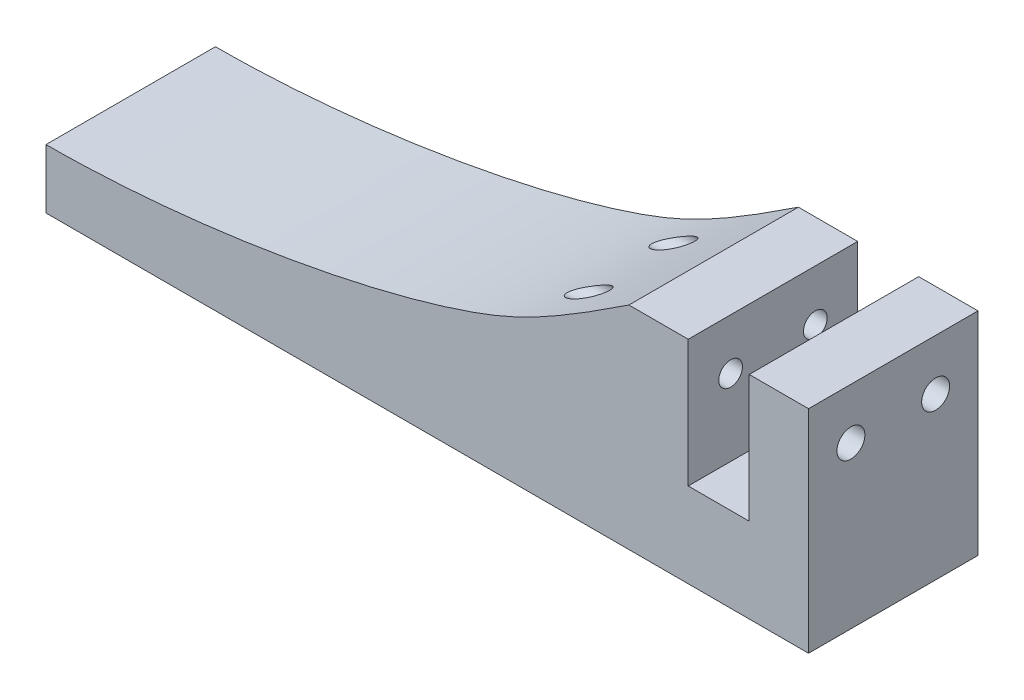
ISO-10303-21;
HEADER;
FILE_DESCRIPTION(('STEP AP214'),'2;1');
FILE_NAME('part.step','',(''),(''),'','','');
FILE_SCHEMA(('AUTOMOTIVE_DESIGN { 1 0 10303 214 1 1 1 1 }'));
ENDSEC;
DATA;
#1=APPLICATION_CONTEXT('core data for automotive mechanical design processes');
#2=APPLICATION_PROTOCOL_DEFINITION('international standard','automotive_design',2000,#1);
#3=PRODUCT_CONTEXT('',#1,'mechanical');
#4=PRODUCT('Part','Part','',(#3));
#5=PRODUCT_RELATED_PRODUCT_CATEGORY('part','',(#4));
#6=PRODUCT_DEFINITION_FORMATION('','',#4);
#7=PRODUCT_DEFINITION_CONTEXT('part definition',#1,'design');
#8=PRODUCT_DEFINITION('design','',#6,#7);
#9=PRODUCT_DEFINITION_SHAPE('','',#8);
#10=(LENGTH_UNIT() NAMED_UNIT(*) SI_UNIT(.MILLI.,.METRE.));
#11=(NAMED_UNIT(*) PLANE_ANGLE_UNIT() SI_UNIT($,.RADIAN.));
#12=(NAMED_UNIT(*) SI_UNIT($,.STERADIAN.) SOLID_ANGLE_UNIT());
#13=UNCERTAINTY_MEASURE_WITH_UNIT(LENGTH_MEASURE(1.E-05),#10,'distance_accuracy_value','');
#14=(GEOMETRIC_REPRESENTATION_CONTEXT(3) GLOBAL_UNCERTAINTY_ASSIGNED_CONTEXT((#13)) GLOBAL_UNIT_ASSIGNED_CONTEXT((#10,
#11,#12)) REPRESENTATION_CONTEXT('',''));
#15=CARTESIAN_POINT('',(0.,0.,0.));
#16=DIRECTION('',(0.,0.,1.));
#17=DIRECTION('',(1.,0.,0.));
#18=AXIS2_PLACEMENT_3D('',#15,#16,#17);
#19=CARTESIAN_POINT('',(7.,123.395512054749,20.));
#20=DIRECTION('',(0.,-1.,0.));
#21=DIRECTION('',(0.,0.,-1.));
#22=AXIS2_PLACEMENT_3D('',#19,#20,#21);
#23=PLANE('',#22);
#24=DIRECTION('',(-1.,0.,0.));
#25=VECTOR('',#24,1.);
#26=CARTESIAN_POINT('',(7.,123.395512054749,0.));
#27=LINE('',#26,#25);
#28=CARTESIAN_POINT('',(7.,123.395512054749,0.));
#29=VERTEX_POINT('',#28);
#30=CARTESIAN_POINT('',(0.,123.395512054749,0.));
#31=VERTEX_POINT('',#30);
#32=EDGE_CURVE('E159',#29,#31,#27,.T.);
#33=ORIENTED_EDGE('',*,*,#32,.T.);
#34=DIRECTION('',(0.,0.,-1.));
#35=VECTOR('',#34,1.);
#36=CARTESIAN_POINT('',(0.,123.395512054749,20.));
#37=LINE('',#36,#35);
#38=CARTESIAN_POINT('',(0.,123.395512054749,20.));
#39=VERTEX_POINT('',#38);
#40=EDGE_CURVE('E11',#39,#31,#37,.T.);
#41=ORIENTED_EDGE('',*,*,#40,.F.);
#42=DIRECTION('',(-1.,0.,0.));
#43=VECTOR('',#42,1.);
#44=CARTESIAN_POINT('',(7.,123.395512054749,20.));
#45=LINE('',#44,#43);
#46=CARTESIAN_POINT('',(7.,123.395512054749,20.));
#47=VERTEX_POINT('',#46);
#48=EDGE_CURVE('E190',#47,#39,#45,.T.);
#49=ORIENTED_EDGE('',*,*,#48,.F.);
#50=DIRECTION('',(0.,0.,-1.));
#51=VECTOR('',#50,1.);
#52=CARTESIAN_POINT('',(7.,123.395512054749,20.));
#53=LINE('',#52,#51);
#54=EDGE_CURVE('E155',#47,#29,#53,.T.);
#55=ORIENTED_EDGE('',*,*,#54,.T.);
#56=EDGE_LOOP('',(#33,#41,#49,#55));
#57=FACE_BOUND('',#56,.T.);
#58=ADVANCED_FACE('F45',(#57),#23,.F.);
#59=CARTESIAN_POINT('',(0.,123.395512054749,20.));
#60=DIRECTION('',(1.,0.,0.));
#61=DIRECTION('',(0.,1.,0.));
#62=AXIS2_PLACEMENT_3D('',#59,#60,#61);
#63=PLANE('',#62);
#64=CARTESIAN_POINT('',(0.,117.395512054749,15.));
#65=DIRECTION('',(1.,0.,0.));
#66=DIRECTION('',(0.,1.,0.));
#67=AXIS2_PLACEMENT_3D('',#64,#65,#66);
#68=CIRCLE('',#67,1.65);
#69=CARTESIAN_POINT('',(0.,119.045512054749,15.));
#70=VERTEX_POINT('',#69);
#71=EDGE_CURVE('E164',#70,#70,#68,.F.);
#72=ORIENTED_EDGE('',*,*,#71,.F.);
#73=EDGE_LOOP('',(#72));
#74=FACE_BOUND('',#73,.T.);
#75=CARTESIAN_POINT('',(0.,117.395512054749,5.00000000000001));
#76=DIRECTION('',(1.,0.,0.));
#77=DIRECTION('',(0.,1.,0.));
#78=AXIS2_PLACEMENT_3D('',#75,#76,#77);
#79=CIRCLE('',#78,1.65);
#80=CARTESIAN_POINT('',(0.,119.045512054749,5.00000000000001));
#81=VERTEX_POINT('',#80);
#82=EDGE_CURVE('E327',#81,#81,#79,.F.);
#83=ORIENTED_EDGE('',*,*,#82,.F.);
#84=EDGE_LOOP('',(#83));
#85=FACE_BOUND('',#84,.T.);
#86=DIRECTION('',(0.,-1.,0.));
#87=VECTOR('',#86,1.);
#88=CARTESIAN_POINT('',(0.,123.395512054749,0.));
#89=LINE('',#88,#87);
#90=CARTESIAN_POINT('',(0.,108.395512054749,0.));
#91=VERTEX_POINT('',#90);
#92=EDGE_CURVE('E163',#31,#91,#89,.T.);
#93=ORIENTED_EDGE('',*,*,#92,.T.);
#94=DIRECTION('',(0.,0.,-1.));
#95=VECTOR('',#94,1.);
#96=CARTESIAN_POINT('',(0.,108.395512054749,20.));
#97=LINE('',#96,#95);
#98=CARTESIAN_POINT('',(0.,108.395512054749,20.));
#99=VERTEX_POINT('',#98);
#100=EDGE_CURVE('E60',#99,#91,#97,.T.);
#101=ORIENTED_EDGE('',*,*,#100,.F.);
#102=DIRECTION('',(0.,-1.,0.));
#103=VECTOR('',#102,1.);
#104=CARTESIAN_POINT('',(0.,123.395512054749,20.));
#105=LINE('',#104,#103);
#106=EDGE_CURVE('E115',#39,#99,#105,.T.);
#107=ORIENTED_EDGE('',*,*,#106,.F.);
#108=ORIENTED_EDGE('',*,*,#40,.T.);
#109=EDGE_LOOP('',(#93,#101,#107,#108));
#110=FACE_BOUND('',#109,.T.);
#111=ADVANCED_FACE('F257',(#74,#85,#110),#63,.F.);
#112=CARTESIAN_POINT('',(0.,108.395512054749,20.));
#113=DIRECTION('',(0.,-1.,0.));
#114=DIRECTION('',(0.,0.,-1.));
#115=AXIS2_PLACEMENT_3D('',#112,#113,#114);
#116=PLANE('',#115);
#117=DIRECTION('',(-1.,0.,0.));
#118=VECTOR('',#117,1.);
#119=CARTESIAN_POINT('',(0.,108.395512054749,0.));
#120=LINE('',#119,#118);
#121=CARTESIAN_POINT('',(-7.2,108.395512054749,0.));
#122=VERTEX_POINT('',#121);
#123=EDGE_CURVE('E167',#91,#122,#120,.T.);
#124=ORIENTED_EDGE('',*,*,#123,.T.);
#125=DIRECTION('',(0.,0.,-1.));
#126=VECTOR('',#125,1.);
#127=CARTESIAN_POINT('',(-7.2,108.395512054749,20.));
#128=LINE('',#127,#126);
#129=CARTESIAN_POINT('',(-7.2,108.395512054749,20.));
#130=VERTEX_POINT('',#129);
#131=EDGE_CURVE('E205',#130,#122,#128,.T.);
#132=ORIENTED_EDGE('',*,*,#131,.F.);
#133=DIRECTION('',(-1.,0.,0.));
#134=VECTOR('',#133,1.);
#135=CARTESIAN_POINT('',(0.,108.395512054749,20.));
#136=LINE('',#135,#134);
#137=EDGE_CURVE('E273',#99,#130,#136,.T.);
#138=ORIENTED_EDGE('',*,*,#137,.F.);
#139=ORIENTED_EDGE('',*,*,#100,.T.);
#140=EDGE_LOOP('',(#124,#132,#138,#139));
#141=FACE_BOUND('',#140,.T.);
#142=ADVANCED_FACE('F263',(#141),#116,.F.);
#143=CARTESIAN_POINT('',(-7.2,108.395512054749,20.));
#144=DIRECTION('',(-1.,0.,0.));
#145=DIRECTION('',(0.,-1.,0.));
#146=AXIS2_PLACEMENT_3D('',#143,#144,#145);
#147=PLANE('',#146);
#148=CARTESIAN_POINT('',(-7.19999999999998,117.395512054749,15.));
#149=DIRECTION('',(1.,0.,0.));
#150=DIRECTION('',(0.,1.,0.));
#151=AXIS2_PLACEMENT_3D('',#148,#149,#150);
#152=CIRCLE('',#151,1.4);
#153=CARTESIAN_POINT('',(-7.19999999999998,118.795512054749,15.));
#154=VERTEX_POINT('',#153);
#155=EDGE_CURVE('E218',#154,#154,#152,.T.);
#156=ORIENTED_EDGE('',*,*,#155,.F.);
#157=EDGE_LOOP('',(#156));
#158=FACE_BOUND('',#157,.T.);
#159=CARTESIAN_POINT('',(-7.19999999999998,117.395512054749,5.00000000000001));
#160=DIRECTION('',(1.,0.,0.));
#161=DIRECTION('',(0.,1.,0.));
#162=AXIS2_PLACEMENT_3D('',#159,#160,#161);
#163=CIRCLE('',#162,1.4);
#164=CARTESIAN_POINT('',(-7.19999999999998,118.795512054749,5.00000000000001));
#165=VERTEX_POINT('',#164);
#166=EDGE_CURVE('E313',#165,#165,#163,.T.);
#167=ORIENTED_EDGE('',*,*,#166,.F.);
#168=EDGE_LOOP('',(#167));
#169=FACE_BOUND('',#168,.T.);
#170=DIRECTION('',(0.,1.,0.));
#171=VECTOR('',#170,1.);
#172=CARTESIAN_POINT('',(-7.2,108.395512054749,0.));
#173=LINE('',#172,#171);
#174=CARTESIAN_POINT('',(-7.2,123.395512054749,0.));
#175=VERTEX_POINT('',#174);
#176=EDGE_CURVE('E170',#122,#175,#173,.T.);
#177=ORIENTED_EDGE('',*,*,#176,.T.);
#178=DIRECTION('',(0.,0.,-1.));
#179=VECTOR('',#178,1.);
#180=CARTESIAN_POINT('',(-7.2,123.395512054749,20.));
#181=LINE('',#180,#179);
#182=CARTESIAN_POINT('',(-7.2,123.395512054749,20.));
#183=VERTEX_POINT('',#182);
#184=EDGE_CURVE('E201',#183,#175,#181,.T.);
#185=ORIENTED_EDGE('',*,*,#184,.F.);
#186=DIRECTION('',(0.,1.,0.));
#187=VECTOR('',#186,1.);
#188=CARTESIAN_POINT('',(-7.2,108.395512054749,20.));
#189=LINE('',#188,#187);
#190=EDGE_CURVE('E276',#130,#183,#189,.T.);
#191=ORIENTED_EDGE('',*,*,#190,.F.);
#192=ORIENTED_EDGE('',*,*,#131,.T.);
#193=EDGE_LOOP('',(#177,#185,#191,#192));
#194=FACE_BOUND('',#193,.T.);
#195=ADVANCED_FACE('F301',(#158,#169,#194),#147,.F.);
#196=CARTESIAN_POINT('',(-7.2,123.395512054749,20.));
#197=DIRECTION('',(0.,-1.,0.));
#198=DIRECTION('',(0.,0.,-1.));
#199=AXIS2_PLACEMENT_3D('',#196,#197,#198);
#200=PLANE('',#199);
#201=DIRECTION('',(-1.,0.,0.));
#202=VECTOR('',#201,1.);
#203=CARTESIAN_POINT('',(-7.2,123.395512054749,0.));
#204=LINE('',#203,#202);
#205=CARTESIAN_POINT('',(-14.2,123.395512054749,0.));
#206=VERTEX_POINT('',#205);
#207=EDGE_CURVE('E173',#175,#206,#204,.T.);
#208=ORIENTED_EDGE('',*,*,#207,.T.);
#209=DIRECTION('',(0.,0.,-1.));
#210=VECTOR('',#209,1.);
#211=CARTESIAN_POINT('',(-14.2,123.395512054749,20.));
#212=LINE('',#211,#210);
#213=CARTESIAN_POINT('',(-14.2,123.395512054749,20.));
#214=VERTEX_POINT('',#213);
#215=EDGE_CURVE('E197',#214,#206,#212,.T.);
#216=ORIENTED_EDGE('',*,*,#215,.F.);
#217=DIRECTION('',(-1.,0.,0.));
#218=VECTOR('',#217,1.);
#219=CARTESIAN_POINT('',(-7.2,123.395512054749,20.));
#220=LINE('',#219,#218);
#221=EDGE_CURVE('E280',#183,#214,#220,.T.);
#222=ORIENTED_EDGE('',*,*,#221,.F.);
#223=ORIENTED_EDGE('',*,*,#184,.T.);
#224=EDGE_LOOP('',(#208,#216,#222,#223));
#225=FACE_BOUND('',#224,.T.);
#226=ADVANCED_FACE('F254',(#225),#200,.F.);
#227=CARTESIAN_POINT('',(-14.2,123.395512054749,20.));
#228=CARTESIAN_POINT('',(-23.5305764736176,117.205565192291,20.));
#229=CARTESIAN_POINT('',(-38.4462109306657,109.915945525106,20.));
#230=CARTESIAN_POINT('',(-66.6914713805971,105.395512054749,20.));
#231=CARTESIAN_POINT('',(-83.,105.395512054749,20.));
#232=B_SPLINE_CURVE_WITH_KNOTS('',3,(#227,#228,#229,#230,#231),.UNSPECIFIED.,.F.,.F.,(4,1,4),
(0.,0.267223525795242,1.),.UNSPECIFIED.);
#233=DIRECTION('',(0.,0.,-1.));
#234=VECTOR('',#233,1.);
#235=SURFACE_OF_LINEAR_EXTRUSION('',#232,#234);
#236=CARTESIAN_POINT('',(-21.4333818446635,118.795512054749,15.));
#237=CARTESIAN_POINT('',(-21.4333851112219,118.795510079946,15.0430449715237));
#238=CARTESIAN_POINT('',(-21.4367365094557,118.793507024554,15.0861093180717));
#239=CARTESIAN_POINT('',(-21.4498103304152,118.785695898685,15.1709099795722));
#240=CARTESIAN_POINT('',(-21.4595401182314,118.7798834295,15.2126447007252));
#241=CARTESIAN_POINT('',(-21.4872633991155,118.763331318774,15.3026491976609));
#242=CARTESIAN_POINT('',(-21.5065984367953,118.751792324466,15.3503530686173));
#243=CARTESIAN_POINT('',(-21.5516741336629,118.724917645317,15.4415380434438));
#244=CARTESIAN_POINT('',(-21.5774335032163,118.709570871297,15.4850062878618));
#245=CARTESIAN_POINT('',(-21.626955921678,118.680100800184,15.5576556453478));
#246=CARTESIAN_POINT('',(-21.649727524072,118.666560036258,15.5877702140347));
#247=CARTESIAN_POINT('',(-21.6974184984586,118.638228215001,15.6455139562833));
#248=CARTESIAN_POINT('',(-21.7223347261669,118.623438988663,15.6731466510033));
#249=CARTESIAN_POINT('',(-21.7998019781786,118.577505127343,15.7527707093798));
#250=CARTESIAN_POINT('',(-21.854974031478,118.544852413108,15.8013523733943));
#251=CARTESIAN_POINT('',(-21.9639392154812,118.480515511215,15.8861727374498));
#252=CARTESIAN_POINT('',(-22.0173069145303,118.449067683378,15.9231629831785));
#253=CARTESIAN_POINT('',(-22.1266510244094,118.38478060914,15.9917441571222));
#254=CARTESIAN_POINT('',(-22.1826290819895,118.351940485626,16.0233316166942));
#255=CARTESIAN_POINT('',(-22.2965437845312,118.285271843067,16.0818023609095));
#256=CARTESIAN_POINT('',(-22.3544835214341,118.251441776289,16.1086777633071));
#257=CARTESIAN_POINT('',(-22.471777523955,118.183129075873,16.1582042591102));
#258=CARTESIAN_POINT('',(-22.5311322662965,118.148646223135,16.1808539054872));
#259=CARTESIAN_POINT('',(-22.7012956446391,118.050050588416,16.2398128627428));
#260=CARTESIAN_POINT('',(-22.8133849383949,117.98541489604,16.2715844356377));
#261=CARTESIAN_POINT('',(-23.0398066813567,117.855541210269,16.3241125400557));
#262=CARTESIAN_POINT('',(-23.1541408658263,117.790302773384,16.3448601722934));
#263=CARTESIAN_POINT('',(-23.3843270897542,117.659702555495,16.3764894485473));
#264=CARTESIAN_POINT('',(-23.5001812876981,117.594340745856,16.3873550585107));
#265=CARTESIAN_POINT('',(-23.7325501826506,117.464033812435,16.3998520990196));
#266=CARTESIAN_POINT('',(-23.8490646444787,117.399088555938,16.4014866331893));
#267=CARTESIAN_POINT('',(-24.0906374364238,117.265293132368,16.3956517900798));
#268=CARTESIAN_POINT('',(-24.2157097694005,117.196496597585,16.3875217121104));
#269=CARTESIAN_POINT('',(-24.465500742723,117.060088220595,16.3610005538766));
#270=CARTESIAN_POINT('',(-24.5902191842989,116.992476963369,16.3426045462938));
#271=CARTESIAN_POINT('',(-24.8385101885245,116.858892645699,16.295017378979));
#272=CARTESIAN_POINT('',(-24.9620825637401,116.792919850358,16.2658244842992));
#273=CARTESIAN_POINT('',(-25.2069321978563,116.66322648865,16.1954965646807));
#274=CARTESIAN_POINT('',(-25.3282116872258,116.599503674969,16.1543738569743));
#275=CARTESIAN_POINT('',(-25.5095362106053,116.504992183601,16.081037352559));
#276=CARTESIAN_POINT('',(-25.5710831585264,116.473050165948,16.0539930330914));
#277=CARTESIAN_POINT('',(-25.6926159388965,116.410240911517,15.9955324431741));
#278=CARTESIAN_POINT('',(-25.7526024695168,116.379373191907,15.9641181693302));
#279=CARTESIAN_POINT('',(-25.8700518580262,116.31918702547,15.8964180206722));
#280=CARTESIAN_POINT('',(-25.9275271489924,116.289860752564,15.860160926405));
#281=CARTESIAN_POINT('',(-26.0392395557247,116.233088614541,15.7817394824872));
#282=CARTESIAN_POINT('',(-26.0934814102157,116.205639988492,15.7395840964574));
#283=CARTESIAN_POINT('',(-26.1803271531172,116.161855841338,15.6628434940606));
#284=CARTESIAN_POINT('',(-26.2142689864664,116.144790583573,15.6301995680819));
#285=CARTESIAN_POINT('',(-26.2790515157686,116.112295820707,15.5610853306371));
#286=CARTESIAN_POINT('',(-26.3098884546442,116.096868296148,15.5246104900195));
#287=CARTESIAN_POINT('',(-26.3674128565502,116.068148382631,15.4470299720603));
#288=CARTESIAN_POINT('',(-26.3940533937931,116.054880091192,15.4058797273214));
#289=CARTESIAN_POINT('',(-26.4407859117862,116.031642346355,15.3191518455995));
#290=CARTESIAN_POINT('',(-26.460894912303,116.021664318195,15.2735861237638));
#291=CARTESIAN_POINT('',(-26.4878269567977,116.008313199532,15.192033805607));
#292=CARTESIAN_POINT('',(-26.4967933667101,116.00387308239,15.1569361780888));
#293=CARTESIAN_POINT('',(-26.5093201809809,115.997671654877,15.0855609150057));
#294=CARTESIAN_POINT('',(-26.5128859845761,115.995907669051,15.0492844950563));
#295=CARTESIAN_POINT('',(-26.51424482869,115.995235334788,14.9765185782138));
#296=CARTESIAN_POINT('',(-26.5120259036067,115.996332905426,14.9400287956846));
#297=CARTESIAN_POINT('',(-26.5020322197086,116.001279283344,14.8680080648051));
#298=CARTESIAN_POINT('',(-26.4942528456537,116.005130376081,14.8324779384214));
#299=CARTESIAN_POINT('',(-26.4713116876441,116.016498661524,14.7545726354214));
#300=CARTESIAN_POINT('',(-26.4547924355123,116.024690727424,14.7127008336744));
#301=CARTESIAN_POINT('',(-26.4159630778905,116.043980684331,14.6324741336607));
#302=CARTESIAN_POINT('',(-26.3936412984848,116.055084433658,14.5941265385993));
#303=CARTESIAN_POINT('',(-26.3303808257915,116.086619030443,14.4994391024493));
#304=CARTESIAN_POINT('',(-26.2862256293863,116.108688987818,14.4458229744635));
#305=CARTESIAN_POINT('',(-26.1914969205402,116.156222864284,14.3463869360182));
#306=CARTESIAN_POINT('',(-26.1409061890983,116.181695898227,14.3005887429848));
#307=CARTESIAN_POINT('',(-26.0371018277418,116.234177872027,14.2166223040116));
#308=CARTESIAN_POINT('',(-25.9839947147812,116.261127415316,14.1782825792615));
#309=CARTESIAN_POINT('',(-25.8751709159946,116.316576912288,14.1067201778763));
#310=CARTESIAN_POINT('',(-25.8194518400578,116.345078290006,14.0735023121456));
#311=CARTESIAN_POINT('',(-25.7061335837801,116.403282260509,14.0114192077366));
#312=CARTESIAN_POINT('',(-25.6485316710101,116.43298661551,13.9825606706596));
#313=CARTESIAN_POINT('',(-25.532013827434,116.493320831104,13.9287000525219));
#314=CARTESIAN_POINT('',(-25.47309743719,116.523951016665,13.903699344812));
#315=CARTESIAN_POINT('',(-25.2968183209555,116.615973512691,13.8345983296922));
#316=CARTESIAN_POINT('',(-25.17807371917,116.678448444399,13.7954296059236));
#317=CARTESIAN_POINT('',(-24.9384916826585,116.805495600074,13.7283753936638));
#318=CARTESIAN_POINT('',(-24.8176524586112,116.870069663063,13.7005001036219));
#319=CARTESIAN_POINT('',(-24.5745979189984,117.000933513051,13.6549656269336));
#320=CARTESIAN_POINT('',(-24.4523799407817,117.0672271456,13.6373318565285));
#321=CARTESIAN_POINT('',(-24.2076175990293,117.200944242268,13.6119182395542));
#322=CARTESIAN_POINT('',(-24.0850733876588,117.268367238117,13.6041344066007));
#323=CARTESIAN_POINT('',(-23.8315764783796,117.408782678164,13.5981780317902));
#324=CARTESIAN_POINT('',(-23.7006381255098,117.481833516263,13.6007194343775));
#325=CARTESIAN_POINT('',(-23.4396627255476,117.62841529568,13.6175373004571));
#326=CARTESIAN_POINT('',(-23.3096263393459,117.701946525248,13.6318216060951));
#327=CARTESIAN_POINT('',(-23.0517035186242,117.84870607213,13.6731896106547));
#328=CARTESIAN_POINT('',(-22.9238131133232,117.921934701153,13.7002461322275));
#329=CARTESIAN_POINT('',(-22.7346005438825,118.030894424288,13.7518439022762));
#330=CARTESIAN_POINT('',(-22.671996324235,118.06704996101,13.770866871017));
#331=CARTESIAN_POINT('',(-22.5479046297029,118.138911218392,13.8129474807135));
#332=CARTESIAN_POINT('',(-22.4864168205975,118.174617072658,13.8360038914351));
#333=CARTESIAN_POINT('',(-22.3695220501327,118.242672832621,13.884682500124));
#334=CARTESIAN_POINT('',(-22.3140078379594,118.275071718329,13.9099770083114));
#335=CARTESIAN_POINT('',(-22.2046594276844,118.339032854717,13.9648459111345));
#336=CARTESIAN_POINT('',(-22.1508244024305,118.370595516123,13.99441815679));
#337=CARTESIAN_POINT('',(-22.0456470269726,118.432389258335,14.0582723352434));
#338=CARTESIAN_POINT('',(-21.994293720653,118.462626124058,14.0925303924987));
#339=CARTESIAN_POINT('',(-21.8946998870683,118.52138004786,14.1665417878313));
#340=CARTESIAN_POINT('',(-21.8464556812324,118.549899135636,14.2062884501745));
#341=CARTESIAN_POINT('',(-21.7619754906521,118.599924340135,14.2850243756348));
#342=CARTESIAN_POINT('',(-21.7250738738275,118.621809770117,14.3230493548683));
#343=CARTESIAN_POINT('',(-21.6554252872969,118.663168531436,14.4040828250279));
#344=CARTESIAN_POINT('',(-21.6226831261025,118.68263907045,14.4470969757596));
#345=CARTESIAN_POINT('',(-21.5626686945132,118.718364048376,14.5389947384378));
#346=CARTESIAN_POINT('',(-21.5354732679991,118.734573268589,14.5879475356518));
#347=CARTESIAN_POINT('',(-21.4895023507261,118.761992846295,14.6909126229609));
#348=CARTESIAN_POINT('',(-21.4706955685659,118.773221780398,14.7449051861083));
#349=CARTESIAN_POINT('',(-21.4494522359091,118.785909671745,14.8330448240114));
#350=CARTESIAN_POINT('',(-21.4434588481016,118.789490560323,14.866050511099));
#351=CARTESIAN_POINT('',(-21.4354235345449,118.79429183144,14.9327004415291));
#352=CARTESIAN_POINT('',(-21.4333792906296,118.795513598794,14.9663442985423));
#353=CARTESIAN_POINT('',(-21.4333818446635,118.795512054749,15.));
#354=B_SPLINE_CURVE_WITH_KNOTS('',3,(#236,#237,#238,#239,#240,#241,#242,#243,#244,#245,#246,
#247,#248,#249,#250,#251,#252,#253,#254,#255,#256,#257,#258,#259,#260,#261,#262,#263,#264,#265,
#266,#267,#268,#269,#270,#271,#272,#273,#274,#275,#276,#277,#278,#279,#280,#281,#282,#283,#284,
#285,#286,#287,#288,#289,#290,#291,#292,#293,#294,#295,#296,#297,#298,#299,#300,#301,#302,#303,
#304,#305,#306,#307,#308,#309,#310,#311,#312,#313,#314,#315,#316,#317,#318,#319,#320,#321,#322,
#323,#324,#325,#326,#327,#328,#329,#330,#331,#332,#333,#334,#335,#336,#337,#338,#339,#340,#341,
#342,#343,#344,#345,#346,#347,#348,#349,#350,#351,#352,#353),.UNSPECIFIED.,.T.,.F.,(4,2,2,2,2,2,
2,2,2,2,2,2,2,2,2,2,2,2,2,2,2,2,2,2,2,2,2,2,2,2,2,2,2,2,2,2,2,2,2,2,2,2,2,2,2,2,2,2,2,2,2,2,2,2,
2,2,2,2,4),(0.,0.129000419266692,0.258150057584118,0.415533285073476,0.573380343948817,
0.693545343268574,0.813537072795541,1.05404521849237,1.27021547938561,1.48652400703364,
1.70319098939477,1.91993202954798,2.31900417018967,2.71839798180523,3.11843867878162,
3.51834486815175,3.94690494368058,4.37567089149517,4.80450576750788,5.23289944854977,
5.45606992846417,5.67913877600264,5.90093648208989,6.12240071154543,6.27246252384666,
6.42270378961039,6.57452122676799,6.72593982628748,6.83497289346235,6.94389688310082,
7.05304635863753,7.16228653492621,7.29877667105841,7.43554356162079,7.65295442636862,
7.8709597407949,8.08312713213484,8.29549261158177,8.50818130910091,8.72094554796499,
9.13962005625357,9.55867180713181,9.97875911776663,10.3986763597497,10.8481060283198,
11.2978360790661,11.7466134562359,11.9707867342886,12.1948917564224,12.4019826660892,
12.6089698997867,12.8149392511762,13.0206602552514,13.1923184682858,13.3641733539567,
13.5382678406394,13.7117073734762,13.8126285788489,13.9134905249736),.UNSPECIFIED.);
#355=CARTESIAN_POINT('',(-21.4333818446635,118.795512054749,15.));
#356=VERTEX_POINT('',#355);
#357=EDGE_CURVE('E48',#356,#356,#354,.T.);
#358=ORIENTED_EDGE('',*,*,#357,.T.);
#359=EDGE_LOOP('',(#358));
#360=FACE_BOUND('',#359,.T.);
#361=CARTESIAN_POINT('',(-21.4333818446635,118.795512054749,5.00000000000001));
#362=CARTESIAN_POINT('',(-21.4333851112219,118.795510079946,5.04304497152371));
#363=CARTESIAN_POINT('',(-21.4367365094557,118.793507024554,5.08610931807172));
#364=CARTESIAN_POINT('',(-21.4498103304152,118.785695898685,5.17090997957224));
#365=CARTESIAN_POINT('',(-21.4595401182313,118.7798834295,5.21264470072524));
#366=CARTESIAN_POINT('',(-21.4872633991155,118.763331318774,5.30264919766092));
#367=CARTESIAN_POINT('',(-21.5065984367953,118.751792324466,5.35035306861726));
#368=CARTESIAN_POINT('',(-21.5516741336629,118.724917645317,5.4415380434438));
#369=CARTESIAN_POINT('',(-21.5774335032163,118.709570871297,5.48500628786175));
#370=CARTESIAN_POINT('',(-21.626955921678,118.680100800184,5.55765564534783));
#371=CARTESIAN_POINT('',(-21.6497275240719,118.666560036258,5.58777021403468));
#372=CARTESIAN_POINT('',(-21.6974184984585,118.638228215001,5.64551395628332));
#373=CARTESIAN_POINT('',(-21.7223347261669,118.623438988663,5.67314665100332));
#374=CARTESIAN_POINT('',(-21.7998019781786,118.577505127343,5.75277070937971));
#375=CARTESIAN_POINT('',(-21.854974031478,118.544852413108,5.80135237339425));
#376=CARTESIAN_POINT('',(-21.9639392154812,118.480515511215,5.88617273744975));
#377=CARTESIAN_POINT('',(-22.0173069145302,118.449067683378,5.92316298317851));
#378=CARTESIAN_POINT('',(-22.1266510244093,118.38478060914,5.99174415712217));
#379=CARTESIAN_POINT('',(-22.1826290819894,118.351940485626,6.02333161669409));
#380=CARTESIAN_POINT('',(-22.2965437845311,118.285271843067,6.08180236090943));
#381=CARTESIAN_POINT('',(-22.354483521434,118.251441776289,6.10867776330702));
#382=CARTESIAN_POINT('',(-22.4717775239549,118.183129075873,6.15820425911011));
#383=CARTESIAN_POINT('',(-22.5311322662963,118.148646223135,6.18085390548711));
#384=CARTESIAN_POINT('',(-22.701295644639,118.050050588416,6.23981286274273));
#385=CARTESIAN_POINT('',(-22.8133849383947,117.98541489604,6.27158443563763));
#386=CARTESIAN_POINT('',(-23.0398066813565,117.855541210269,6.32411254005567));
#387=CARTESIAN_POINT('',(-23.1541408658261,117.790302773384,6.3448601722934));
#388=CARTESIAN_POINT('',(-23.384327089754,117.659702555495,6.37648944854729));
#389=CARTESIAN_POINT('',(-23.5001812876979,117.594340745856,6.38735505851064));
#390=CARTESIAN_POINT('',(-23.7325501826503,117.464033812435,6.3998520990196));
#391=CARTESIAN_POINT('',(-23.8490646444784,117.399088555939,6.40148663318932));
#392=CARTESIAN_POINT('',(-24.0906374364234,117.265293132368,6.39565179007986));
#393=CARTESIAN_POINT('',(-24.2157097694002,117.196496597585,6.38752171211043));
#394=CARTESIAN_POINT('',(-24.4655007427227,117.060088220595,6.36100055387665));
#395=CARTESIAN_POINT('',(-24.5902191842985,116.992476963369,6.34260454629386));
#396=CARTESIAN_POINT('',(-24.8385101885241,116.858892645699,6.29501737897912));
#397=CARTESIAN_POINT('',(-24.9620825637397,116.792919850358,6.26582448429935));
#398=CARTESIAN_POINT('',(-25.2069321978559,116.66322648865,6.19549656468085));
#399=CARTESIAN_POINT('',(-25.3282116872254,116.599503674969,6.15437385697444));
#400=CARTESIAN_POINT('',(-25.5095362106049,116.504992183601,6.08103735255918));
#401=CARTESIAN_POINT('',(-25.571083158526,116.473050165948,6.05399303309154));
#402=CARTESIAN_POINT('',(-25.6926159388961,116.410240911518,5.99553244317425));
#403=CARTESIAN_POINT('',(-25.7526024695164,116.379373191907,5.9641181693304));
#404=CARTESIAN_POINT('',(-25.8700518580259,116.31918702547,5.89641802067245));
#405=CARTESIAN_POINT('',(-25.9275271489921,116.289860752564,5.86016092640521));
#406=CARTESIAN_POINT('',(-26.0392395557244,116.233088614541,5.78173948248749));
#407=CARTESIAN_POINT('',(-26.0934814102154,116.205639988492,5.73958409645764));
#408=CARTESIAN_POINT('',(-26.180327153117,116.161855841338,5.6628434940609));
#409=CARTESIAN_POINT('',(-26.2142689864662,116.144790583573,5.63019956808221));
#410=CARTESIAN_POINT('',(-26.2790515157684,116.112295820707,5.56108533063733));
#411=CARTESIAN_POINT('',(-26.3098884546439,116.096868296148,5.52461049001968));
#412=CARTESIAN_POINT('',(-26.36741285655,116.068148382631,5.44702997206058));
#413=CARTESIAN_POINT('',(-26.3940533937931,116.054880091192,5.40587972732167));
#414=CARTESIAN_POINT('',(-26.4407859117862,116.031642346355,5.31915184559977));
#415=CARTESIAN_POINT('',(-26.4608949123029,116.021664318195,5.27358612376404));
#416=CARTESIAN_POINT('',(-26.4878269567976,116.008313199532,5.19203380560718));
#417=CARTESIAN_POINT('',(-26.49679336671,116.00387308239,5.15693617808906));
#418=CARTESIAN_POINT('',(-26.5093201809809,115.997671654877,5.08556091500595));
#419=CARTESIAN_POINT('',(-26.5128859845761,115.995907669051,5.04928449505652));
#420=CARTESIAN_POINT('',(-26.51424482869,115.995235334788,4.97651857821401));
#421=CARTESIAN_POINT('',(-26.5120259036067,115.996332905426,4.94002879568482));
#422=CARTESIAN_POINT('',(-26.5020322197087,116.001279283344,4.86800806480528));
#423=CARTESIAN_POINT('',(-26.4942528456538,116.005130376081,4.83247793842154));
#424=CARTESIAN_POINT('',(-26.4713116876442,116.016498661524,4.75457263542157));
#425=CARTESIAN_POINT('',(-26.4547924355123,116.024690727424,4.7127008336746));
#426=CARTESIAN_POINT('',(-26.4159630778905,116.043980684331,4.63247413366098));
#427=CARTESIAN_POINT('',(-26.3936412984849,116.055084433658,4.59412653859948));
#428=CARTESIAN_POINT('',(-26.3303808257918,116.086619030443,4.49943910244945));
#429=CARTESIAN_POINT('',(-26.2862256293866,116.108688987818,4.44582297446367));
#430=CARTESIAN_POINT('',(-26.1914969205405,116.156222864284,4.34638693601842));
#431=CARTESIAN_POINT('',(-26.1409061890986,116.181695898227,4.30058874298504));
#432=CARTESIAN_POINT('',(-26.0371018277421,116.234177872027,4.21662230401186));
#433=CARTESIAN_POINT('',(-25.9839947147816,116.261127415316,4.17828257926184));
#434=CARTESIAN_POINT('',(-25.8751709159951,116.316576912288,4.10672017787664));
#435=CARTESIAN_POINT('',(-25.8194518400584,116.345078290006,4.07350231214588));
#436=CARTESIAN_POINT('',(-25.7061335837807,116.403282260509,4.01141920773692));
#437=CARTESIAN_POINT('',(-25.6485316710108,116.43298661551,3.98256067065986));
#438=CARTESIAN_POINT('',(-25.5320138274347,116.493320831104,3.92870005252227));
#439=CARTESIAN_POINT('',(-25.4730974371908,116.523951016665,3.90369934481237));
#440=CARTESIAN_POINT('',(-25.2968183209564,116.61597351269,3.83459832969249));
#441=CARTESIAN_POINT('',(-25.178073719171,116.678448444399,3.79542960592388));
#442=CARTESIAN_POINT('',(-24.9384916826595,116.805495600073,3.72837539366403));
#443=CARTESIAN_POINT('',(-24.8176524586123,116.870069663062,3.70050010362214));
#444=CARTESIAN_POINT('',(-24.5745979189996,117.00093351305,3.65496562693377));
#445=CARTESIAN_POINT('',(-24.452379940783,117.0672271456,3.63733185652866));
#446=CARTESIAN_POINT('',(-24.2076175990306,117.200944242267,3.61191823955431));
#447=CARTESIAN_POINT('',(-24.0850733876602,117.268367238116,3.60413440660081));
#448=CARTESIAN_POINT('',(-23.8315764783811,117.408782678164,3.59817803179022));
#449=CARTESIAN_POINT('',(-23.7006381255114,117.481833516262,3.60071943437749));
#450=CARTESIAN_POINT('',(-23.4396627255492,117.628415295679,3.617537300457));
#451=CARTESIAN_POINT('',(-23.3096263393475,117.701946525247,3.63182160609486));
#452=CARTESIAN_POINT('',(-23.051703518626,117.848706072129,3.67318961065439));
#453=CARTESIAN_POINT('',(-22.923813113325,117.921934701152,3.70024613222711));
#454=CARTESIAN_POINT('',(-22.7346005438843,118.030894424287,3.75184390227565));
#455=CARTESIAN_POINT('',(-22.6719963242368,118.067049961009,3.77086687101646));
#456=CARTESIAN_POINT('',(-22.5479046297047,118.138911218391,3.81294748071288));
#457=CARTESIAN_POINT('',(-22.4864168205993,118.174617072657,3.83600389143442));
#458=CARTESIAN_POINT('',(-22.3695220501345,118.24267283262,3.88468250012319));
#459=CARTESIAN_POINT('',(-22.3140078379611,118.275071718328,3.90997700831056));
#460=CARTESIAN_POINT('',(-22.204659427686,118.339032854717,3.96484591113358));
#461=CARTESIAN_POINT('',(-22.1508244024321,118.370595516122,3.99441815678912));
#462=CARTESIAN_POINT('',(-22.0456470269741,118.432389258334,4.05827233524242));
#463=CARTESIAN_POINT('',(-21.9942937206544,118.462626124057,4.0925303924977));
#464=CARTESIAN_POINT('',(-21.8946998870696,118.521380047859,4.16654178783025));
#465=CARTESIAN_POINT('',(-21.8464556812336,118.549899135635,4.20628845017344));
#466=CARTESIAN_POINT('',(-21.7619754906532,118.599924340134,4.28502437563377));
#467=CARTESIAN_POINT('',(-21.7250738738286,118.621809770117,4.32304935486728));
#468=CARTESIAN_POINT('',(-21.6554252872978,118.663168531436,4.40408282502678));
#469=CARTESIAN_POINT('',(-21.6226831261033,118.682639070449,4.44709697575847));
#470=CARTESIAN_POINT('',(-21.5626686945139,118.718364048375,4.53899473843664));
#471=CARTESIAN_POINT('',(-21.5354732679997,118.734573268588,4.58794753565072));
#472=CARTESIAN_POINT('',(-21.4895023507265,118.761992846295,4.69091262295977));
#473=CARTESIAN_POINT('',(-21.4706955685662,118.773221780397,4.74490518610716));
#474=CARTESIAN_POINT('',(-21.4494522359092,118.785909671745,4.83304482401053));
#475=CARTESIAN_POINT('',(-21.4434588481016,118.789490560322,4.86605051109825));
#476=CARTESIAN_POINT('',(-21.4354235345449,118.79429183144,4.93270044152874));
#477=CARTESIAN_POINT('',(-21.4333792906296,118.795513598794,4.96634429854209));
#478=CARTESIAN_POINT('',(-21.4333818446635,118.795512054749,5.00000000000001));
#479=B_SPLINE_CURVE_WITH_KNOTS('',3,(#361,#362,#363,#364,#365,#366,#367,#368,#369,#370,#371,
#372,#373,#374,#375,#376,#377,#378,#379,#380,#381,#382,#383,#384,#385,#386,#387,#388,#389,#390,
#391,#392,#393,#394,#395,#396,#397,#398,#399,#400,#401,#402,#403,#404,#405,#406,#407,#408,#409,
#410,#411,#412,#413,#414,#415,#416,#417,#418,#419,#420,#421,#422,#423,#424,#425,#426,#427,#428,
#429,#430,#431,#432,#433,#434,#435,#436,#437,#438,#439,#440,#441,#442,#443,#444,#445,#446,#447,
#448,#449,#450,#451,#452,#453,#454,#455,#456,#457,#458,#459,#460,#461,#462,#463,#464,#465,#466,
#467,#468,#469,#470,#471,#472,#473,#474,#475,#476,#477,#478),.UNSPECIFIED.,.T.,.F.,(4,2,2,2,2,2,
2,2,2,2,2,2,2,2,2,2,2,2,2,2,2,2,2,2,2,2,2,2,2,2,2,2,2,2,2,2,2,2,2,2,2,2,2,2,2,2,2,2,2,2,2,2,2,2,
2,2,2,2,4),(0.,0.129000419266686,0.258150057584102,0.415533285073446,0.573380343948792,
0.693545343268545,0.813537072795501,1.05404521849232,1.27021547938552,1.48652400703352,
1.70319098939463,1.91993202954783,2.31900417018949,2.71839798180499,3.11843867878132,
3.5183448681514,3.94690494368019,4.37567089149473,4.8045057675074,5.23289944854928,
5.4560699284637,5.67913877600221,5.90093648208949,6.12240071154506,6.27246252384631,
6.42270378961009,6.57452122676773,6.72593982628726,6.83497289346216,6.94389688310064,
7.05304635863736,7.16228653492604,7.29877667105821,7.43554356162055,7.65295442636829,
7.8709597407945,8.08312713213431,8.29549261158109,8.5081813091001,8.72094554796405,
9.13962005625246,9.55867180713051,9.97875911776517,10.398676359748,10.8481060283181,
11.2978360790641,11.7466134562338,11.9707867342864,12.1948917564202,12.4019826660871,
12.6089698997847,12.8149392511744,13.0206602552498,13.1923184682842,13.3641733539553,
13.5382678406382,13.7117073734751,13.8126285788484,13.9134905249736),.UNSPECIFIED.);
#480=CARTESIAN_POINT('',(-21.4333818446635,118.795512054749,5.00000000000001));
#481=VERTEX_POINT('',#480);
#482=EDGE_CURVE('E211',#481,#481,#479,.T.);
#483=ORIENTED_EDGE('',*,*,#482,.T.);
#484=EDGE_LOOP('',(#483));
#485=FACE_BOUND('',#484,.T.);
#486=CARTESIAN_POINT('',(-14.2,123.395512054749,0.));
#487=CARTESIAN_POINT('',(-23.5305764736176,117.205565192291,0.));
#488=CARTESIAN_POINT('',(-38.4462109306657,109.915945525106,0.));
#489=CARTESIAN_POINT('',(-66.6914713805971,105.395512054749,0.));
#490=CARTESIAN_POINT('',(-83.,105.395512054749,0.));
#491=B_SPLINE_CURVE_WITH_KNOTS('',3,(#486,#487,#488,#489,#490),.UNSPECIFIED.,.F.,.F.,(4,1,4),
(0.,0.267223525795242,1.),.UNSPECIFIED.);
#492=CARTESIAN_POINT('',(-83.,105.395512054749,0.));
#493=VERTEX_POINT('',#492);
#494=EDGE_CURVE('E176',#206,#493,#491,.T.);
#495=ORIENTED_EDGE('',*,*,#494,.T.);
#496=DIRECTION('',(0.,0.,-1.));
#497=VECTOR('',#496,1.);
#498=CARTESIAN_POINT('',(-83.,105.395512054749,20.));
#499=LINE('',#498,#497);
#500=CARTESIAN_POINT('',(-83.,105.395512054749,20.));
#501=VERTEX_POINT('',#500);
#502=EDGE_CURVE('E148',#501,#493,#499,.T.);
#503=ORIENTED_EDGE('',*,*,#502,.F.);
#504=EDGE_CURVE('E137',#214,#501,#232,.T.);
#505=ORIENTED_EDGE('',*,*,#504,.F.);
#506=ORIENTED_EDGE('',*,*,#215,.T.);
#507=EDGE_LOOP('',(#495,#503,#505,#506));
#508=FACE_BOUND('',#507,.T.);
#509=ADVANCED_FACE('F219',(#360,#485,#508),#235,.F.);
#510=CARTESIAN_POINT('',(-83.,105.395512054749,20.));
#511=DIRECTION('',(1.,0.,0.));
#512=DIRECTION('',(0.,0.,-1.));
#513=AXIS2_PLACEMENT_3D('',#510,#511,#512);
#514=PLANE('',#513);
#515=DIRECTION('',(0.,-1.,0.));
#516=VECTOR('',#515,1.);
#517=CARTESIAN_POINT('',(-83.,105.395512054749,0.));
#518=LINE('',#517,#516);
#519=CARTESIAN_POINT('',(-83.,98.3955120547487,0.));
#520=VERTEX_POINT('',#519);
#521=EDGE_CURVE('E146',#493,#520,#518,.T.);
#522=ORIENTED_EDGE('',*,*,#521,.T.);
#523=DIRECTION('',(0.,0.,-1.));
#524=VECTOR('',#523,1.);
#525=CARTESIAN_POINT('',(-83.,98.3955120547487,20.));
#526=LINE('',#525,#524);
#527=CARTESIAN_POINT('',(-83.,98.3955120547487,20.));
#528=VERTEX_POINT('',#527);
#529=EDGE_CURVE('E143',#528,#520,#526,.T.);
#530=ORIENTED_EDGE('',*,*,#529,.F.);
#531=DIRECTION('',(0.,-1.,0.));
#532=VECTOR('',#531,1.);
#533=CARTESIAN_POINT('',(-83.,105.395512054749,20.));
#534=LINE('',#533,#532);
#535=EDGE_CURVE('E131',#501,#528,#534,.T.);
#536=ORIENTED_EDGE('',*,*,#535,.F.);
#537=ORIENTED_EDGE('',*,*,#502,.T.);
#538=EDGE_LOOP('',(#522,#530,#536,#537));
#539=FACE_BOUND('',#538,.T.);
#540=ADVANCED_FACE('F144',(#539),#514,.F.);
#541=CARTESIAN_POINT('',(-83.,98.3955120547487,20.));
#542=DIRECTION('',(0.,1.,0.));
#543=DIRECTION('',(0.,0.,1.));
#544=AXIS2_PLACEMENT_3D('',#541,#542,#543);
#545=PLANE('',#544);
#546=DIRECTION('',(1.,0.,0.));
#547=VECTOR('',#546,1.);
#548=CARTESIAN_POINT('',(-83.,98.3955120547487,0.));
#549=LINE('',#548,#547);
#550=CARTESIAN_POINT('',(7.,98.3955120547487,0.));
#551=VERTEX_POINT('',#550);
#552=EDGE_CURVE('E101',#520,#551,#549,.T.);
#553=ORIENTED_EDGE('',*,*,#552,.T.);
#554=DIRECTION('',(0.,0.,-1.));
#555=VECTOR('',#554,1.);
#556=CARTESIAN_POINT('',(7.,98.3955120547487,20.));
#557=LINE('',#556,#555);
#558=CARTESIAN_POINT('',(7.,98.3955120547487,20.));
#559=VERTEX_POINT('',#558);
#560=EDGE_CURVE('E149',#559,#551,#557,.T.);
#561=ORIENTED_EDGE('',*,*,#560,.F.);
#562=DIRECTION('',(1.,0.,0.));
#563=VECTOR('',#562,1.);
#564=CARTESIAN_POINT('',(-83.,98.3955120547487,20.));
#565=LINE('',#564,#563);
#566=EDGE_CURVE('E135',#528,#559,#565,.T.);
#567=ORIENTED_EDGE('',*,*,#566,.F.);
#568=ORIENTED_EDGE('',*,*,#529,.T.);
#569=EDGE_LOOP('',(#553,#561,#567,#568));
#570=FACE_BOUND('',#569,.T.);
#571=ADVANCED_FACE('F151',(#570),#545,.F.);
#572=CARTESIAN_POINT('',(7.,98.3955120547487,20.));
#573=DIRECTION('',(-1.,0.,0.));
#574=DIRECTION('',(0.,0.,1.));
#575=AXIS2_PLACEMENT_3D('',#572,#573,#574);
#576=PLANE('',#575);
#577=CARTESIAN_POINT('',(7.,117.395512054749,15.));
#578=DIRECTION('',(1.,0.,0.));
#579=DIRECTION('',(0.,1.,0.));
#580=AXIS2_PLACEMENT_3D('',#577,#578,#579);
#581=CIRCLE('',#580,1.65);
#582=CARTESIAN_POINT('',(7.,119.045512054749,15.));
#583=VERTEX_POINT('',#582);
#584=EDGE_CURVE('E319',#583,#583,#581,.T.);
#585=ORIENTED_EDGE('',*,*,#584,.F.);
#586=EDGE_LOOP('',(#585));
#587=FACE_BOUND('',#586,.T.);
#588=CARTESIAN_POINT('',(7.,117.395512054749,5.00000000000001));
#589=DIRECTION('',(1.,0.,0.));
#590=DIRECTION('',(0.,1.,0.));
#591=AXIS2_PLACEMENT_3D('',#588,#589,#590);
#592=CIRCLE('',#591,1.65);
#593=CARTESIAN_POINT('',(7.,119.045512054749,5.00000000000001));
#594=VERTEX_POINT('',#593);
#595=EDGE_CURVE('E323',#594,#594,#592,.T.);
#596=ORIENTED_EDGE('',*,*,#595,.F.);
#597=EDGE_LOOP('',(#596));
#598=FACE_BOUND('',#597,.T.);
#599=DIRECTION('',(0.,1.,0.));
#600=VECTOR('',#599,1.);
#601=CARTESIAN_POINT('',(7.,98.3955120547487,0.));
#602=LINE('',#601,#600);
#603=EDGE_CURVE('E107',#551,#29,#602,.T.);
#604=ORIENTED_EDGE('',*,*,#603,.T.);
#605=ORIENTED_EDGE('',*,*,#54,.F.);
#606=DIRECTION('',(0.,1.,0.));
#607=VECTOR('',#606,1.);
#608=CARTESIAN_POINT('',(7.,98.3955120547487,20.));
#609=LINE('',#608,#607);
#610=EDGE_CURVE('E69',#559,#47,#609,.T.);
#611=ORIENTED_EDGE('',*,*,#610,.F.);
#612=ORIENTED_EDGE('',*,*,#560,.T.);
#613=EDGE_LOOP('',(#604,#605,#611,#612));
#614=FACE_BOUND('',#613,.T.);
#615=ADVANCED_FACE('F241',(#587,#598,#614),#576,.F.);
#616=CARTESIAN_POINT('',(-47.1541755314751,109.44225686892,20.));
#617=DIRECTION('',(0.,0.,1.));
#618=DIRECTION('',(1.,0.,0.));
#619=AXIS2_PLACEMENT_3D('',#616,#617,#618);
#620=PLANE('',#619);
#621=ORIENTED_EDGE('',*,*,#48,.T.);
#622=ORIENTED_EDGE('',*,*,#106,.T.);
#623=ORIENTED_EDGE('',*,*,#137,.T.);
#624=ORIENTED_EDGE('',*,*,#190,.T.);
#625=ORIENTED_EDGE('',*,*,#221,.T.);
#626=ORIENTED_EDGE('',*,*,#504,.T.);
#627=ORIENTED_EDGE('',*,*,#535,.T.);
#628=ORIENTED_EDGE('',*,*,#566,.T.);
#629=ORIENTED_EDGE('',*,*,#610,.T.);
#630=EDGE_LOOP('',(#621,#622,#623,#624,#625,#626,#627,#628,#629));
#631=FACE_BOUND('',#630,.T.);
#632=ADVANCED_FACE('F133',(#631),#620,.T.);
#633=CARTESIAN_POINT('',(-47.1541755314751,109.44225686892,0.));
#634=DIRECTION('',(0.,0.,1.));
#635=DIRECTION('',(1.,0.,0.));
#636=AXIS2_PLACEMENT_3D('',#633,#634,#635);
#637=PLANE('',#636);
#638=ORIENTED_EDGE('',*,*,#32,.F.);
#639=ORIENTED_EDGE('',*,*,#603,.F.);
#640=ORIENTED_EDGE('',*,*,#552,.F.);
#641=ORIENTED_EDGE('',*,*,#521,.F.);
#642=ORIENTED_EDGE('',*,*,#494,.F.);
#643=ORIENTED_EDGE('',*,*,#207,.F.);
#644=ORIENTED_EDGE('',*,*,#176,.F.);
#645=ORIENTED_EDGE('',*,*,#123,.F.);
#646=ORIENTED_EDGE('',*,*,#92,.F.);
#647=EDGE_LOOP('',(#638,#639,#640,#641,#642,#643,#644,#645,#646));
#648=FACE_BOUND('',#647,.T.);
#649=ADVANCED_FACE('F237',(#648),#637,.F.);
#650=CARTESIAN_POINT('',(-4.66690475583121,117.395512054749,5.00000000000001));
#651=DIRECTION('',(1.,0.,0.));
#652=DIRECTION('',(0.,1.,0.));
#653=AXIS2_PLACEMENT_3D('',#650,#651,#652);
#654=CYLINDRICAL_SURFACE('',#653,1.65);
#655=ORIENTED_EDGE('',*,*,#82,.T.);
#656=EDGE_LOOP('',(#655));
#657=FACE_BOUND('',#656,.T.);
#658=ORIENTED_EDGE('',*,*,#595,.T.);
#659=EDGE_LOOP('',(#658));
#660=FACE_BOUND('',#659,.T.);
#661=ADVANCED_FACE('F233',(#657,#660),#654,.F.);
#662=CARTESIAN_POINT('',(-4.66690475583121,117.395512054749,15.));
#663=DIRECTION('',(1.,0.,0.));
#664=DIRECTION('',(0.,1.,0.));
#665=AXIS2_PLACEMENT_3D('',#662,#663,#664);
#666=CYLINDRICAL_SURFACE('',#665,1.65);
#667=ORIENTED_EDGE('',*,*,#71,.T.);
#668=EDGE_LOOP('',(#667));
#669=FACE_BOUND('',#668,.T.);
#670=ORIENTED_EDGE('',*,*,#584,.T.);
#671=EDGE_LOOP('',(#670));
#672=FACE_BOUND('',#671,.T.);
#673=ADVANCED_FACE('F228',(#669,#672),#666,.F.);
#674=CARTESIAN_POINT('',(-34.2,117.395512054749,5.00000000000001));
#675=DIRECTION('',(1.,0.,0.));
#676=DIRECTION('',(0.,1.,0.));
#677=AXIS2_PLACEMENT_3D('',#674,#675,#676);
#678=CYLINDRICAL_SURFACE('',#677,1.4);
#679=ORIENTED_EDGE('',*,*,#166,.T.);
#680=EDGE_LOOP('',(#679));
#681=FACE_BOUND('',#680,.T.);
#682=ORIENTED_EDGE('',*,*,#482,.F.);
#683=EDGE_LOOP('',(#682));
#684=FACE_BOUND('',#683,.T.);
#685=ADVANCED_FACE('F223',(#681,#684),#678,.F.);
#686=CARTESIAN_POINT('',(-34.2,117.395512054749,15.));
#687=DIRECTION('',(1.,0.,0.));
#688=DIRECTION('',(0.,1.,0.));
#689=AXIS2_PLACEMENT_3D('',#686,#687,#688);
#690=CYLINDRICAL_SURFACE('',#689,1.4);
#691=ORIENTED_EDGE('',*,*,#155,.T.);
#692=EDGE_LOOP('',(#691));
#693=FACE_BOUND('',#692,.T.);
#694=ORIENTED_EDGE('',*,*,#357,.F.);
#695=EDGE_LOOP('',(#694));
#696=FACE_BOUND('',#695,.T.);
#697=ADVANCED_FACE('F227',(#693,#696),#690,.F.);
#698=CLOSED_SHELL('',(#58,#111,#142,#195,#226,#509,#540,#571,#615,#632,#649,#661,#673,#685,#697));
#699=MANIFOLD_SOLID_BREP('B2',#698);
#700=ADVANCED_BREP_SHAPE_REPRESENTATION('',(#18,#699),#14);
#701=SHAPE_DEFINITION_REPRESENTATION(#9,#700);
ENDSEC;
END-ISO-10303-21;
